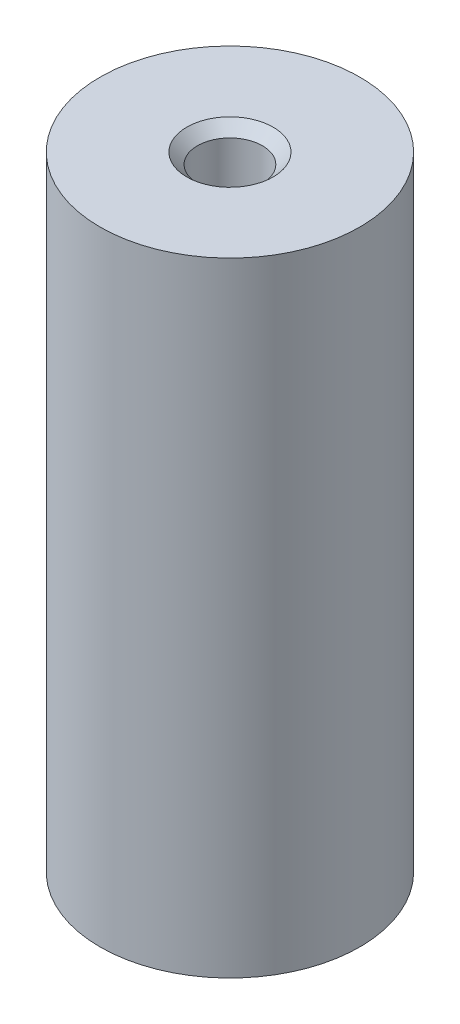
ISO-10303-21;
HEADER;
FILE_DESCRIPTION(('STEP AP214'),'2;1');
FILE_NAME('part.step','',(''),(''),'','','');
FILE_SCHEMA(('AUTOMOTIVE_DESIGN { 1 0 10303 214 1 1 1 1 }'));
ENDSEC;
DATA;
#1=APPLICATION_CONTEXT('core data for automotive mechanical design processes');
#2=APPLICATION_PROTOCOL_DEFINITION('international standard','automotive_design',2000,#1);
#3=PRODUCT_CONTEXT('',#1,'mechanical');
#4=PRODUCT('Part','Part','',(#3));
#5=PRODUCT_RELATED_PRODUCT_CATEGORY('part','',(#4));
#6=PRODUCT_DEFINITION_FORMATION('','',#4);
#7=PRODUCT_DEFINITION_CONTEXT('part definition',#1,'design');
#8=PRODUCT_DEFINITION('design','',#6,#7);
#9=PRODUCT_DEFINITION_SHAPE('','',#8);
#10=(LENGTH_UNIT() NAMED_UNIT(*) SI_UNIT(.MILLI.,.METRE.));
#11=(NAMED_UNIT(*) PLANE_ANGLE_UNIT() SI_UNIT($,.RADIAN.));
#12=(NAMED_UNIT(*) SI_UNIT($,.STERADIAN.) SOLID_ANGLE_UNIT());
#13=UNCERTAINTY_MEASURE_WITH_UNIT(LENGTH_MEASURE(1.E-05),#10,'distance_accuracy_value','');
#14=(GEOMETRIC_REPRESENTATION_CONTEXT(3) GLOBAL_UNCERTAINTY_ASSIGNED_CONTEXT((#13)) GLOBAL_UNIT_ASSIGNED_CONTEXT((#10,
#11,#12)) REPRESENTATION_CONTEXT('',''));
#15=CARTESIAN_POINT('',(0.,0.,0.));
#16=DIRECTION('',(0.,0.,1.));
#17=DIRECTION('',(1.,0.,0.));
#18=AXIS2_PLACEMENT_3D('',#15,#16,#17);
#19=CARTESIAN_POINT('',(0.,48.,0.));
#20=DIRECTION('',(0.,-1.,0.));
#21=DIRECTION('',(0.,0.,-1.));
#22=AXIS2_PLACEMENT_3D('',#19,#20,#21);
#23=CYLINDRICAL_SURFACE('',#22,10.);
#24=CARTESIAN_POINT('',(0.,48.,0.));
#25=DIRECTION('',(0.,1.,0.));
#26=DIRECTION('',(0.,0.,1.));
#27=AXIS2_PLACEMENT_3D('',#24,#25,#26);
#28=CIRCLE('',#27,10.);
#29=CARTESIAN_POINT('',(0.,48.,10.));
#30=VERTEX_POINT('',#29);
#31=EDGE_CURVE('E11',#30,#30,#28,.T.);
#32=ORIENTED_EDGE('',*,*,#31,.F.);
#33=EDGE_LOOP('',(#32));
#34=FACE_BOUND('',#33,.T.);
#35=CARTESIAN_POINT('',(0.,0.,0.));
#36=DIRECTION('',(0.,1.,0.));
#37=DIRECTION('',(0.,0.,1.));
#38=AXIS2_PLACEMENT_3D('',#35,#36,#37);
#39=CIRCLE('',#38,10.);
#40=CARTESIAN_POINT('',(0.,0.,10.));
#41=VERTEX_POINT('',#40);
#42=EDGE_CURVE('E48',#41,#41,#39,.T.);
#43=ORIENTED_EDGE('',*,*,#42,.T.);
#44=EDGE_LOOP('',(#43));
#45=FACE_BOUND('',#44,.T.);
#46=ADVANCED_FACE('F45',(#34,#45),#23,.T.);
#47=CARTESIAN_POINT('',(0.,48.,0.));
#48=DIRECTION('',(0.,1.,0.));
#49=DIRECTION('',(0.,0.,1.));
#50=AXIS2_PLACEMENT_3D('',#47,#48,#49);
#51=PLANE('',#50);
#52=CARTESIAN_POINT('',(0.,48.,0.));
#53=DIRECTION('',(0.,1.,0.));
#54=DIRECTION('',(0.,0.,1.));
#55=AXIS2_PLACEMENT_3D('',#52,#53,#54);
#56=CIRCLE('',#55,3.325);
#57=CARTESIAN_POINT('',(0.,48.,3.325));
#58=VERTEX_POINT('',#57);
#59=EDGE_CURVE('E72',#58,#58,#56,.T.);
#60=ORIENTED_EDGE('',*,*,#59,.F.);
#61=EDGE_LOOP('',(#60));
#62=FACE_BOUND('',#61,.T.);
#63=ORIENTED_EDGE('',*,*,#31,.T.);
#64=EDGE_LOOP('',(#63));
#65=FACE_BOUND('',#64,.T.);
#66=ADVANCED_FACE('F81',(#62,#65),#51,.T.);
#67=CARTESIAN_POINT('',(0.,0.,0.));
#68=DIRECTION('',(0.,1.,0.));
#69=DIRECTION('',(0.,0.,1.));
#70=AXIS2_PLACEMENT_3D('',#67,#68,#69);
#71=PLANE('',#70);
#72=ORIENTED_EDGE('',*,*,#42,.F.);
#73=EDGE_LOOP('',(#72));
#74=FACE_BOUND('',#73,.T.);
#75=ADVANCED_FACE('F59',(#74),#71,.F.);
#76=CARTESIAN_POINT('',(0.,31.,0.));
#77=DIRECTION('',(0.,1.,0.));
#78=DIRECTION('',(0.,0.,1.));
#79=AXIS2_PLACEMENT_3D('',#76,#77,#78);
#80=CONICAL_SURFACE('',#79,2.5,1.02974425867665);
#81=CARTESIAN_POINT('',(0.,29.4978484524311,0.));
#82=VERTEX_POINT('',#81);
#83=VERTEX_LOOP('',#82);
#84=FACE_BOUND('',#83,.T.);
#85=CARTESIAN_POINT('',(0.,31.,0.));
#86=DIRECTION('',(0.,1.,0.));
#87=DIRECTION('',(0.,0.,1.));
#88=AXIS2_PLACEMENT_3D('',#85,#86,#87);
#89=CIRCLE('',#88,2.5);
#90=CARTESIAN_POINT('',(0.,31.,2.5));
#91=VERTEX_POINT('',#90);
#92=EDGE_CURVE('E63',#91,#91,#89,.T.);
#93=ORIENTED_EDGE('',*,*,#92,.T.);
#94=EDGE_LOOP('',(#93));
#95=FACE_BOUND('',#94,.T.);
#96=ADVANCED_FACE('F55',(#84,#95),#80,.F.);
#97=CARTESIAN_POINT('',(0.,48.,0.));
#98=DIRECTION('',(0.,1.,0.));
#99=DIRECTION('',(0.,0.,1.));
#100=AXIS2_PLACEMENT_3D('',#97,#98,#99);
#101=CYLINDRICAL_SURFACE('',#100,2.5);
#102=ORIENTED_EDGE('',*,*,#92,.F.);
#103=EDGE_LOOP('',(#102));
#104=FACE_BOUND('',#103,.T.);
#105=CARTESIAN_POINT('',(0.,47.175,0.));
#106=DIRECTION('',(0.,1.,0.));
#107=DIRECTION('',(0.,0.,1.));
#108=AXIS2_PLACEMENT_3D('',#105,#106,#107);
#109=CIRCLE('',#108,2.5);
#110=CARTESIAN_POINT('',(0.,47.175,2.5));
#111=VERTEX_POINT('',#110);
#112=EDGE_CURVE('E66',#111,#111,#109,.T.);
#113=ORIENTED_EDGE('',*,*,#112,.T.);
#114=EDGE_LOOP('',(#113));
#115=FACE_BOUND('',#114,.T.);
#116=ADVANCED_FACE('F58',(#104,#115),#101,.F.);
#117=CARTESIAN_POINT('',(0.,48.,0.));
#118=DIRECTION('',(0.,1.,0.));
#119=DIRECTION('',(0.,0.,1.));
#120=AXIS2_PLACEMENT_3D('',#117,#118,#119);
#121=CONICAL_SURFACE('',#120,3.325,0.78539816339745);
#122=ORIENTED_EDGE('',*,*,#112,.F.);
#123=EDGE_LOOP('',(#122));
#124=FACE_BOUND('',#123,.T.);
#125=ORIENTED_EDGE('',*,*,#59,.T.);
#126=EDGE_LOOP('',(#125));
#127=FACE_BOUND('',#126,.T.);
#128=ADVANCED_FACE('F79',(#124,#127),#121,.F.);
#129=CLOSED_SHELL('',(#46,#66,#75,#96,#116,#128));
#130=MANIFOLD_SOLID_BREP('B2',#129);
#131=ADVANCED_BREP_SHAPE_REPRESENTATION('',(#18,#130),#14);
#132=SHAPE_DEFINITION_REPRESENTATION(#9,#131);
ENDSEC;
END-ISO-10303-21;
